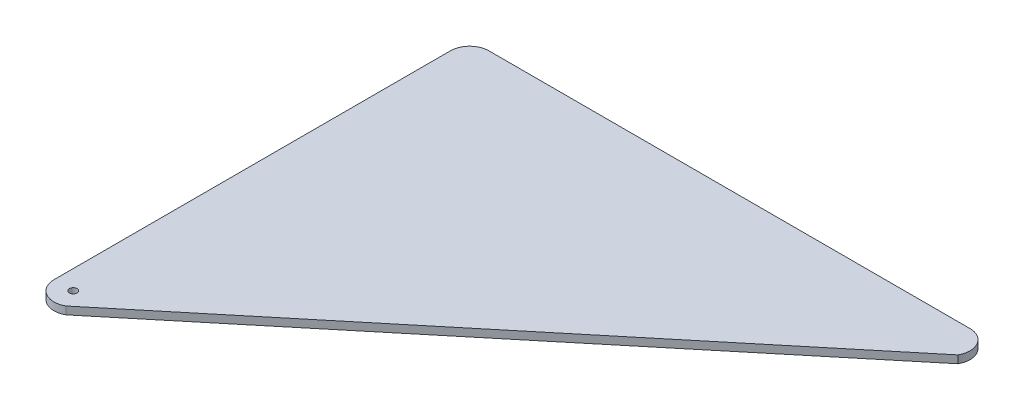
ISO-10303-21;
HEADER;
FILE_DESCRIPTION(('STEP AP214'),'2;1');
FILE_NAME('part.step','',(''),(''),'','','');
FILE_SCHEMA(('AUTOMOTIVE_DESIGN { 1 0 10303 214 1 1 1 1 }'));
ENDSEC;
DATA;
#1=APPLICATION_CONTEXT('core data for automotive mechanical design processes');
#2=APPLICATION_PROTOCOL_DEFINITION('international standard','automotive_design',2000,#1);
#3=PRODUCT_CONTEXT('',#1,'mechanical');
#4=PRODUCT('Part','Part','',(#3));
#5=PRODUCT_RELATED_PRODUCT_CATEGORY('part','',(#4));
#6=PRODUCT_DEFINITION_FORMATION('','',#4);
#7=PRODUCT_DEFINITION_CONTEXT('part definition',#1,'design');
#8=PRODUCT_DEFINITION('design','',#6,#7);
#9=PRODUCT_DEFINITION_SHAPE('','',#8);
#10=(LENGTH_UNIT() NAMED_UNIT(*) SI_UNIT(.MILLI.,.METRE.));
#11=(NAMED_UNIT(*) PLANE_ANGLE_UNIT() SI_UNIT($,.RADIAN.));
#12=(NAMED_UNIT(*) SI_UNIT($,.STERADIAN.) SOLID_ANGLE_UNIT());
#13=UNCERTAINTY_MEASURE_WITH_UNIT(LENGTH_MEASURE(1.E-05),#10,'distance_accuracy_value','');
#14=(GEOMETRIC_REPRESENTATION_CONTEXT(3) GLOBAL_UNCERTAINTY_ASSIGNED_CONTEXT((#13)) GLOBAL_UNIT_ASSIGNED_CONTEXT((#10,
#11,#12)) REPRESENTATION_CONTEXT('',''));
#15=CARTESIAN_POINT('',(0.,0.,0.));
#16=DIRECTION('',(0.,0.,1.));
#17=DIRECTION('',(1.,0.,0.));
#18=AXIS2_PLACEMENT_3D('',#15,#16,#17);
#19=CARTESIAN_POINT('',(0.,2.,0.));
#20=DIRECTION('',(0.,-1.,0.));
#21=DIRECTION('',(0.,0.,-1.));
#22=AXIS2_PLACEMENT_3D('',#19,#20,#21);
#23=PLANE('',#22);
#24=CARTESIAN_POINT('',(0.,2.,0.));
#25=DIRECTION('',(0.,1.,0.));
#26=DIRECTION('',(0.,0.,-1.));
#27=AXIS2_PLACEMENT_3D('',#24,#25,#26);
#28=CIRCLE('',#27,5.);
#29=CARTESIAN_POINT('',(-5.,2.,0.));
#30=VERTEX_POINT('',#29);
#31=CARTESIAN_POINT('',(2.50000000000002,2.,4.33012701892218));
#32=VERTEX_POINT('',#31);
#33=EDGE_CURVE('E135',#30,#32,#28,.T.);
#34=ORIENTED_EDGE('',*,*,#33,.T.);
#35=DIRECTION('',(0.770799511619907,0.,-0.637077791864159));
#36=VECTOR('',#35,1.);
#37=CARTESIAN_POINT('',(129.333821145766,2.,-100.5));
#38=LINE('',#37,#36);
#39=CARTESIAN_POINT('',(129.333821145766,2.,-100.5));
#40=VERTEX_POINT('',#39);
#41=EDGE_CURVE('E93',#32,#40,#38,.T.);
#42=ORIENTED_EDGE('',*,*,#41,.T.);
#43=CARTESIAN_POINT('',(125.003694126843,2.,-103.));
#44=DIRECTION('',(0.,1.,0.));
#45=DIRECTION('',(0.,0.,-1.));
#46=AXIS2_PLACEMENT_3D('',#43,#44,#45);
#47=CIRCLE('',#46,5.);
#48=CARTESIAN_POINT('',(125.003694126843,2.,-108.));
#49=VERTEX_POINT('',#48);
#50=EDGE_CURVE('E106',#40,#49,#47,.T.);
#51=ORIENTED_EDGE('',*,*,#50,.T.);
#52=DIRECTION('',(-1.,0.,0.));
#53=VECTOR('',#52,1.);
#54=CARTESIAN_POINT('',(0.,2.,-108.));
#55=LINE('',#54,#53);
#56=CARTESIAN_POINT('',(0.,2.,-108.));
#57=VERTEX_POINT('',#56);
#58=EDGE_CURVE('E100',#49,#57,#55,.T.);
#59=ORIENTED_EDGE('',*,*,#58,.T.);
#60=CARTESIAN_POINT('',(0.,2.,-103.));
#61=DIRECTION('',(0.,1.,0.));
#62=DIRECTION('',(0.,0.,-1.));
#63=AXIS2_PLACEMENT_3D('',#60,#61,#62);
#64=CIRCLE('',#63,5.);
#65=CARTESIAN_POINT('',(-5.,2.,-103.));
#66=VERTEX_POINT('',#65);
#67=EDGE_CURVE('E104',#57,#66,#64,.T.);
#68=ORIENTED_EDGE('',*,*,#67,.T.);
#69=DIRECTION('',(0.,0.,1.));
#70=VECTOR('',#69,1.);
#71=CARTESIAN_POINT('',(-5.,2.,-103.));
#72=LINE('',#71,#70);
#73=EDGE_CURVE('E56',#66,#30,#72,.T.);
#74=ORIENTED_EDGE('',*,*,#73,.T.);
#75=EDGE_LOOP('',(#34,#42,#51,#59,#68,#74));
#76=FACE_BOUND('',#75,.T.);
#77=CARTESIAN_POINT('',(0.,2.,0.));
#78=DIRECTION('',(0.,1.,0.));
#79=DIRECTION('',(0.,0.,1.));
#80=AXIS2_PLACEMENT_3D('',#77,#78,#79);
#81=CIRCLE('',#80,1.);
#82=CARTESIAN_POINT('',(0.,2.,1.));
#83=VERTEX_POINT('',#82);
#84=EDGE_CURVE('E128',#83,#83,#81,.T.);
#85=ORIENTED_EDGE('',*,*,#84,.F.);
#86=EDGE_LOOP('',(#85));
#87=FACE_BOUND('',#86,.T.);
#88=ADVANCED_FACE('F39',(#76,#87),#23,.F.);
#89=CARTESIAN_POINT('',(0.,0.,0.));
#90=DIRECTION('',(0.,-1.,0.));
#91=DIRECTION('',(0.,0.,-1.));
#92=AXIS2_PLACEMENT_3D('',#89,#90,#91);
#93=PLANE('',#92);
#94=CARTESIAN_POINT('',(0.,0.,0.));
#95=DIRECTION('',(0.,1.,0.));
#96=DIRECTION('',(0.,0.,-1.));
#97=AXIS2_PLACEMENT_3D('',#94,#95,#96);
#98=CIRCLE('',#97,5.);
#99=CARTESIAN_POINT('',(-5.,0.,0.));
#100=VERTEX_POINT('',#99);
#101=CARTESIAN_POINT('',(2.50000000000002,0.,4.33012701892218));
#102=VERTEX_POINT('',#101);
#103=EDGE_CURVE('E124',#100,#102,#98,.T.);
#104=ORIENTED_EDGE('',*,*,#103,.F.);
#105=DIRECTION('',(0.,0.,1.));
#106=VECTOR('',#105,1.);
#107=CARTESIAN_POINT('',(-5.,0.,-103.));
#108=LINE('',#107,#106);
#109=CARTESIAN_POINT('',(-5.,0.,-103.));
#110=VERTEX_POINT('',#109);
#111=EDGE_CURVE('E85',#110,#100,#108,.T.);
#112=ORIENTED_EDGE('',*,*,#111,.F.);
#113=CARTESIAN_POINT('',(0.,0.,-103.));
#114=DIRECTION('',(0.,1.,0.));
#115=DIRECTION('',(0.,0.,-1.));
#116=AXIS2_PLACEMENT_3D('',#113,#114,#115);
#117=CIRCLE('',#116,5.);
#118=CARTESIAN_POINT('',(0.,0.,-108.));
#119=VERTEX_POINT('',#118);
#120=EDGE_CURVE('E79',#119,#110,#117,.T.);
#121=ORIENTED_EDGE('',*,*,#120,.F.);
#122=DIRECTION('',(-1.,0.,0.));
#123=VECTOR('',#122,1.);
#124=CARTESIAN_POINT('',(0.,0.,-108.));
#125=LINE('',#124,#123);
#126=CARTESIAN_POINT('',(125.003694126843,0.,-108.));
#127=VERTEX_POINT('',#126);
#128=EDGE_CURVE('E114',#127,#119,#125,.T.);
#129=ORIENTED_EDGE('',*,*,#128,.F.);
#130=CARTESIAN_POINT('',(125.003694126843,0.,-103.));
#131=DIRECTION('',(0.,1.,0.));
#132=DIRECTION('',(0.,0.,-1.));
#133=AXIS2_PLACEMENT_3D('',#130,#131,#132);
#134=CIRCLE('',#133,5.);
#135=CARTESIAN_POINT('',(129.333821145766,0.,-100.5));
#136=VERTEX_POINT('',#135);
#137=EDGE_CURVE('E130',#136,#127,#134,.T.);
#138=ORIENTED_EDGE('',*,*,#137,.F.);
#139=DIRECTION('',(0.770799511619907,0.,-0.637077791864159));
#140=VECTOR('',#139,1.);
#141=CARTESIAN_POINT('',(129.333821145766,0.,-100.5));
#142=LINE('',#141,#140);
#143=EDGE_CURVE('E127',#102,#136,#142,.T.);
#144=ORIENTED_EDGE('',*,*,#143,.F.);
#145=EDGE_LOOP('',(#104,#112,#121,#129,#138,#144));
#146=FACE_BOUND('',#145,.T.);
#147=CARTESIAN_POINT('',(0.,0.,0.));
#148=DIRECTION('',(0.,1.,0.));
#149=DIRECTION('',(0.,0.,1.));
#150=AXIS2_PLACEMENT_3D('',#147,#148,#149);
#151=CIRCLE('',#150,1.);
#152=CARTESIAN_POINT('',(0.,0.,1.));
#153=VERTEX_POINT('',#152);
#154=EDGE_CURVE('E246',#153,#153,#151,.T.);
#155=ORIENTED_EDGE('',*,*,#154,.T.);
#156=EDGE_LOOP('',(#155));
#157=FACE_BOUND('',#156,.T.);
#158=ADVANCED_FACE('F144',(#146,#157),#93,.T.);
#159=CARTESIAN_POINT('',(0.,2.,0.));
#160=DIRECTION('',(0.,-1.,0.));
#161=DIRECTION('',(0.,0.,-1.));
#162=AXIS2_PLACEMENT_3D('',#159,#160,#161);
#163=CYLINDRICAL_SURFACE('',#162,5.);
#164=ORIENTED_EDGE('',*,*,#103,.T.);
#165=DIRECTION('',(0.,-1.,0.));
#166=VECTOR('',#165,1.);
#167=CARTESIAN_POINT('',(2.50000000000002,2.,4.33012701892218));
#168=LINE('',#167,#166);
#169=EDGE_CURVE('E11',#32,#102,#168,.T.);
#170=ORIENTED_EDGE('',*,*,#169,.F.);
#171=ORIENTED_EDGE('',*,*,#33,.F.);
#172=DIRECTION('',(0.,-1.,0.));
#173=VECTOR('',#172,1.);
#174=CARTESIAN_POINT('',(-5.,2.,0.));
#175=LINE('',#174,#173);
#176=EDGE_CURVE('E120',#30,#100,#175,.T.);
#177=ORIENTED_EDGE('',*,*,#176,.T.);
#178=EDGE_LOOP('',(#164,#170,#171,#177));
#179=FACE_BOUND('',#178,.T.);
#180=ADVANCED_FACE('F41',(#179),#163,.T.);
#181=CARTESIAN_POINT('',(129.333821145766,2.,-100.5));
#182=DIRECTION('',(-0.637077791864159,0.,-0.770799511619907));
#183=DIRECTION('',(-0.770799511619907,0.,0.637077791864159));
#184=AXIS2_PLACEMENT_3D('',#181,#182,#183);
#185=PLANE('',#184);
#186=ORIENTED_EDGE('',*,*,#143,.T.);
#187=DIRECTION('',(0.,-1.,0.));
#188=VECTOR('',#187,1.);
#189=CARTESIAN_POINT('',(129.333821145766,2.,-100.5));
#190=LINE('',#189,#188);
#191=EDGE_CURVE('E48',#40,#136,#190,.T.);
#192=ORIENTED_EDGE('',*,*,#191,.F.);
#193=ORIENTED_EDGE('',*,*,#41,.F.);
#194=ORIENTED_EDGE('',*,*,#169,.T.);
#195=EDGE_LOOP('',(#186,#192,#193,#194));
#196=FACE_BOUND('',#195,.T.);
#197=ADVANCED_FACE('F169',(#196),#185,.F.);
#198=CARTESIAN_POINT('',(125.003694126843,2.,-103.));
#199=DIRECTION('',(0.,-1.,0.));
#200=DIRECTION('',(0.,0.,-1.));
#201=AXIS2_PLACEMENT_3D('',#198,#199,#200);
#202=CYLINDRICAL_SURFACE('',#201,5.);
#203=ORIENTED_EDGE('',*,*,#137,.T.);
#204=DIRECTION('',(0.,-1.,0.));
#205=VECTOR('',#204,1.);
#206=CARTESIAN_POINT('',(125.003694126843,2.,-108.));
#207=LINE('',#206,#205);
#208=EDGE_CURVE('E115',#49,#127,#207,.T.);
#209=ORIENTED_EDGE('',*,*,#208,.F.);
#210=ORIENTED_EDGE('',*,*,#50,.F.);
#211=ORIENTED_EDGE('',*,*,#191,.T.);
#212=EDGE_LOOP('',(#203,#209,#210,#211));
#213=FACE_BOUND('',#212,.T.);
#214=ADVANCED_FACE('F141',(#213),#202,.T.);
#215=CARTESIAN_POINT('',(0.,2.,-108.));
#216=DIRECTION('',(0.,0.,1.));
#217=DIRECTION('',(1.,0.,0.));
#218=AXIS2_PLACEMENT_3D('',#215,#216,#217);
#219=PLANE('',#218);
#220=ORIENTED_EDGE('',*,*,#128,.T.);
#221=DIRECTION('',(0.,-1.,0.));
#222=VECTOR('',#221,1.);
#223=CARTESIAN_POINT('',(0.,2.,-108.));
#224=LINE('',#223,#222);
#225=EDGE_CURVE('E111',#57,#119,#224,.T.);
#226=ORIENTED_EDGE('',*,*,#225,.F.);
#227=ORIENTED_EDGE('',*,*,#58,.F.);
#228=ORIENTED_EDGE('',*,*,#208,.T.);
#229=EDGE_LOOP('',(#220,#226,#227,#228));
#230=FACE_BOUND('',#229,.T.);
#231=ADVANCED_FACE('F112',(#230),#219,.F.);
#232=CARTESIAN_POINT('',(0.,2.,-103.));
#233=DIRECTION('',(0.,-1.,0.));
#234=DIRECTION('',(0.,0.,-1.));
#235=AXIS2_PLACEMENT_3D('',#232,#233,#234);
#236=CYLINDRICAL_SURFACE('',#235,5.);
#237=ORIENTED_EDGE('',*,*,#120,.T.);
#238=DIRECTION('',(0.,-1.,0.));
#239=VECTOR('',#238,1.);
#240=CARTESIAN_POINT('',(-5.,2.,-103.));
#241=LINE('',#240,#239);
#242=EDGE_CURVE('E116',#66,#110,#241,.T.);
#243=ORIENTED_EDGE('',*,*,#242,.F.);
#244=ORIENTED_EDGE('',*,*,#67,.F.);
#245=ORIENTED_EDGE('',*,*,#225,.T.);
#246=EDGE_LOOP('',(#237,#243,#244,#245));
#247=FACE_BOUND('',#246,.T.);
#248=ADVANCED_FACE('F118',(#247),#236,.T.);
#249=CARTESIAN_POINT('',(-5.,2.,-103.));
#250=DIRECTION('',(1.,0.,0.));
#251=DIRECTION('',(0.,0.,-1.));
#252=AXIS2_PLACEMENT_3D('',#249,#250,#251);
#253=PLANE('',#252);
#254=ORIENTED_EDGE('',*,*,#111,.T.);
#255=ORIENTED_EDGE('',*,*,#176,.F.);
#256=ORIENTED_EDGE('',*,*,#73,.F.);
#257=ORIENTED_EDGE('',*,*,#242,.T.);
#258=EDGE_LOOP('',(#254,#255,#256,#257));
#259=FACE_BOUND('',#258,.T.);
#260=ADVANCED_FACE('F149',(#259),#253,.F.);
#261=CARTESIAN_POINT('',(0.,2.,0.));
#262=DIRECTION('',(0.,-1.,0.));
#263=DIRECTION('',(0.,0.,-1.));
#264=AXIS2_PLACEMENT_3D('',#261,#262,#263);
#265=CYLINDRICAL_SURFACE('',#264,1.);
#266=ORIENTED_EDGE('',*,*,#84,.T.);
#267=EDGE_LOOP('',(#266));
#268=FACE_BOUND('',#267,.T.);
#269=ORIENTED_EDGE('',*,*,#154,.F.);
#270=EDGE_LOOP('',(#269));
#271=FACE_BOUND('',#270,.T.);
#272=ADVANCED_FACE('F151',(#268,#271),#265,.F.);
#273=CLOSED_SHELL('',(#88,#158,#180,#197,#214,#231,#248,#260,#272));
#274=MANIFOLD_SOLID_BREP('B2',#273);
#275=ADVANCED_BREP_SHAPE_REPRESENTATION('',(#18,#274),#14);
#276=SHAPE_DEFINITION_REPRESENTATION(#9,#275);
ENDSEC;
END-ISO-10303-21;
